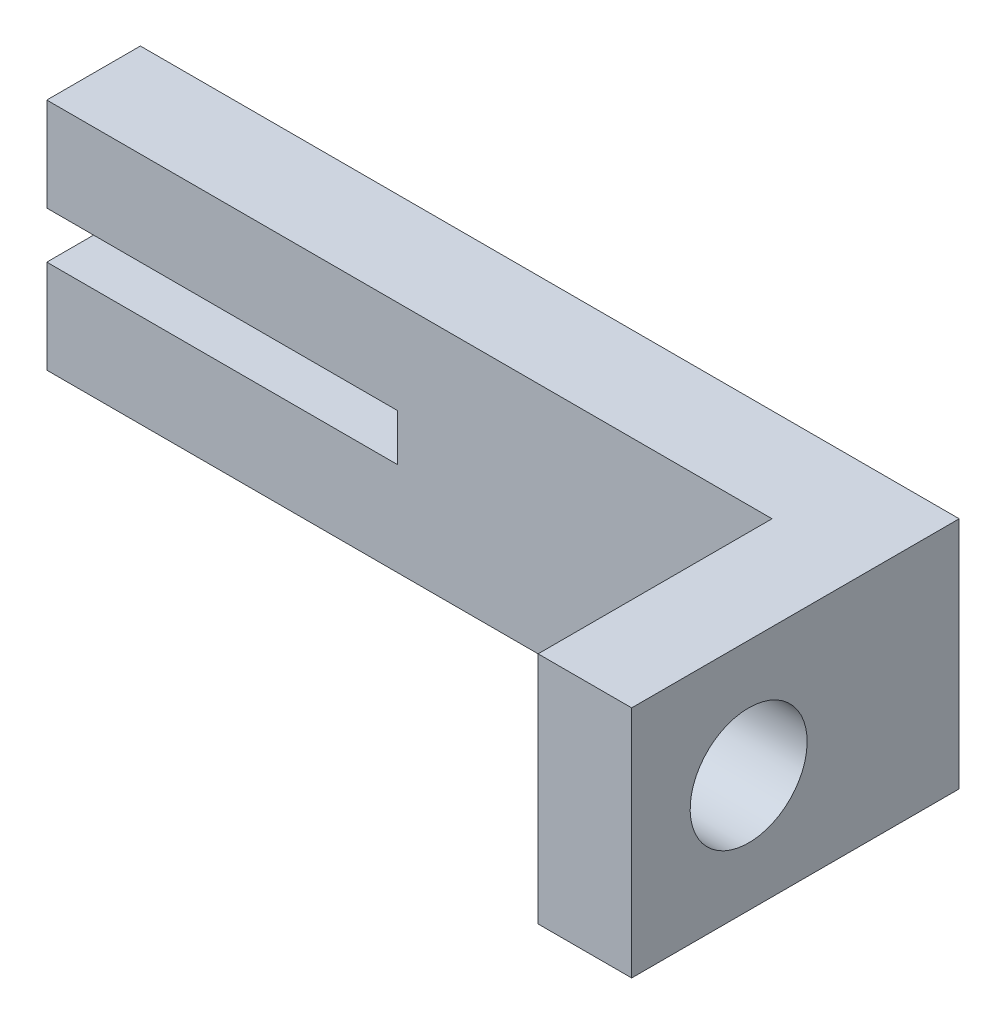
ISO-10303-21;
HEADER;
FILE_DESCRIPTION(('STEP AP214'),'2;1');
FILE_NAME('part.step','',(''),(''),'','','');
FILE_SCHEMA(('AUTOMOTIVE_DESIGN { 1 0 10303 214 1 1 1 1 }'));
ENDSEC;
DATA;
#1=APPLICATION_CONTEXT('core data for automotive mechanical design processes');
#2=APPLICATION_PROTOCOL_DEFINITION('international standard','automotive_design',2000,#1);
#3=PRODUCT_CONTEXT('',#1,'mechanical');
#4=PRODUCT('Part','Part','',(#3));
#5=PRODUCT_RELATED_PRODUCT_CATEGORY('part','',(#4));
#6=PRODUCT_DEFINITION_FORMATION('','',#4);
#7=PRODUCT_DEFINITION_CONTEXT('part definition',#1,'design');
#8=PRODUCT_DEFINITION('design','',#6,#7);
#9=PRODUCT_DEFINITION_SHAPE('','',#8);
#10=(LENGTH_UNIT() NAMED_UNIT(*) SI_UNIT(.MILLI.,.METRE.));
#11=(NAMED_UNIT(*) PLANE_ANGLE_UNIT() SI_UNIT($,.RADIAN.));
#12=(NAMED_UNIT(*) SI_UNIT($,.STERADIAN.) SOLID_ANGLE_UNIT());
#13=UNCERTAINTY_MEASURE_WITH_UNIT(LENGTH_MEASURE(1.E-05),#10,'distance_accuracy_value','');
#14=(GEOMETRIC_REPRESENTATION_CONTEXT(3) GLOBAL_UNCERTAINTY_ASSIGNED_CONTEXT((#13)) GLOBAL_UNIT_ASSIGNED_CONTEXT((#10,
#11,#12)) REPRESENTATION_CONTEXT('',''));
#15=CARTESIAN_POINT('',(0.,0.,0.));
#16=DIRECTION('',(0.,0.,1.));
#17=DIRECTION('',(1.,0.,0.));
#18=AXIS2_PLACEMENT_3D('',#15,#16,#17);
#19=CARTESIAN_POINT('',(0.,0.,4.));
#20=DIRECTION('',(-1.,0.,0.));
#21=DIRECTION('',(0.,0.,1.));
#22=AXIS2_PLACEMENT_3D('',#19,#20,#21);
#23=PLANE('',#22);
#24=DIRECTION('',(0.,1.,0.));
#25=VECTOR('',#24,1.);
#26=CARTESIAN_POINT('',(0.,0.,0.));
#27=LINE('',#26,#25);
#28=CARTESIAN_POINT('',(0.,6.,0.));
#29=VERTEX_POINT('',#28);
#30=CARTESIAN_POINT('',(0.,10.,0.));
#31=VERTEX_POINT('',#30);
#32=EDGE_CURVE('E147',#29,#31,#27,.T.);
#33=ORIENTED_EDGE('',*,*,#32,.F.);
#34=DIRECTION('',(0.,0.,-1.));
#35=VECTOR('',#34,1.);
#36=CARTESIAN_POINT('',(0.,6.,4.));
#37=LINE('',#36,#35);
#38=CARTESIAN_POINT('',(0.,6.,4.));
#39=VERTEX_POINT('',#38);
#40=EDGE_CURVE('E11',#39,#29,#37,.T.);
#41=ORIENTED_EDGE('',*,*,#40,.F.);
#42=DIRECTION('',(0.,1.,0.));
#43=VECTOR('',#42,1.);
#44=CARTESIAN_POINT('',(0.,0.,4.));
#45=LINE('',#44,#43);
#46=CARTESIAN_POINT('',(0.,10.,4.));
#47=VERTEX_POINT('',#46);
#48=EDGE_CURVE('E174',#39,#47,#45,.T.);
#49=ORIENTED_EDGE('',*,*,#48,.T.);
#50=DIRECTION('',(0.,0.,-1.));
#51=VECTOR('',#50,1.);
#52=CARTESIAN_POINT('',(0.,10.,4.));
#53=LINE('',#52,#51);
#54=EDGE_CURVE('E65',#47,#31,#53,.T.);
#55=ORIENTED_EDGE('',*,*,#54,.T.);
#56=EDGE_LOOP('',(#33,#41,#49,#55));
#57=FACE_BOUND('',#56,.T.);
#58=ADVANCED_FACE('F41',(#57),#23,.T.);
#59=CARTESIAN_POINT('',(0.,6.,4.));
#60=DIRECTION('',(0.,1.,0.));
#61=DIRECTION('',(0.,0.,1.));
#62=AXIS2_PLACEMENT_3D('',#59,#60,#61);
#63=PLANE('',#62);
#64=DIRECTION('',(1.,0.,0.));
#65=VECTOR('',#64,1.);
#66=CARTESIAN_POINT('',(0.,6.,0.));
#67=LINE('',#66,#65);
#68=CARTESIAN_POINT('',(15.,6.,0.));
#69=VERTEX_POINT('',#68);
#70=EDGE_CURVE('E150',#29,#69,#67,.T.);
#71=ORIENTED_EDGE('',*,*,#70,.T.);
#72=DIRECTION('',(0.,0.,-1.));
#73=VECTOR('',#72,1.);
#74=CARTESIAN_POINT('',(15.,6.,4.));
#75=LINE('',#74,#73);
#76=CARTESIAN_POINT('',(15.,6.,4.));
#77=VERTEX_POINT('',#76);
#78=EDGE_CURVE('E50',#77,#69,#75,.T.);
#79=ORIENTED_EDGE('',*,*,#78,.F.);
#80=DIRECTION('',(1.,0.,0.));
#81=VECTOR('',#80,1.);
#82=CARTESIAN_POINT('',(0.,6.,4.));
#83=LINE('',#82,#81);
#84=EDGE_CURVE('E235',#39,#77,#83,.T.);
#85=ORIENTED_EDGE('',*,*,#84,.F.);
#86=ORIENTED_EDGE('',*,*,#40,.T.);
#87=EDGE_LOOP('',(#71,#79,#85,#86));
#88=FACE_BOUND('',#87,.T.);
#89=ADVANCED_FACE('F239',(#88),#63,.F.);
#90=CARTESIAN_POINT('',(15.,0.,4.));
#91=DIRECTION('',(1.,0.,0.));
#92=DIRECTION('',(0.,1.,0.));
#93=AXIS2_PLACEMENT_3D('',#90,#91,#92);
#94=PLANE('',#93);
#95=DIRECTION('',(0.,-1.,0.));
#96=VECTOR('',#95,1.);
#97=CARTESIAN_POINT('',(15.,0.,0.));
#98=LINE('',#97,#96);
#99=CARTESIAN_POINT('',(15.,4.,0.));
#100=VERTEX_POINT('',#99);
#101=EDGE_CURVE('E154',#69,#100,#98,.T.);
#102=ORIENTED_EDGE('',*,*,#101,.T.);
#103=DIRECTION('',(0.,0.,-1.));
#104=VECTOR('',#103,1.);
#105=CARTESIAN_POINT('',(15.,4.,4.));
#106=LINE('',#105,#104);
#107=CARTESIAN_POINT('',(15.,4.,4.));
#108=VERTEX_POINT('',#107);
#109=EDGE_CURVE('E124',#108,#100,#106,.T.);
#110=ORIENTED_EDGE('',*,*,#109,.F.);
#111=DIRECTION('',(0.,-1.,0.));
#112=VECTOR('',#111,1.);
#113=CARTESIAN_POINT('',(15.,0.,4.));
#114=LINE('',#113,#112);
#115=EDGE_CURVE('E131',#77,#108,#114,.T.);
#116=ORIENTED_EDGE('',*,*,#115,.F.);
#117=ORIENTED_EDGE('',*,*,#78,.T.);
#118=EDGE_LOOP('',(#102,#110,#116,#117));
#119=FACE_BOUND('',#118,.T.);
#120=ADVANCED_FACE('F193',(#119),#94,.F.);
#121=CARTESIAN_POINT('',(0.,4.,4.));
#122=DIRECTION('',(0.,1.,0.));
#123=DIRECTION('',(0.,0.,1.));
#124=AXIS2_PLACEMENT_3D('',#121,#122,#123);
#125=PLANE('',#124);
#126=DIRECTION('',(1.,0.,0.));
#127=VECTOR('',#126,1.);
#128=CARTESIAN_POINT('',(0.,4.,0.));
#129=LINE('',#128,#127);
#130=CARTESIAN_POINT('',(0.,4.,0.));
#131=VERTEX_POINT('',#130);
#132=EDGE_CURVE('E118',#131,#100,#129,.T.);
#133=ORIENTED_EDGE('',*,*,#132,.F.);
#134=DIRECTION('',(0.,0.,-1.));
#135=VECTOR('',#134,1.);
#136=CARTESIAN_POINT('',(0.,4.,4.));
#137=LINE('',#136,#135);
#138=CARTESIAN_POINT('',(0.,4.,4.));
#139=VERTEX_POINT('',#138);
#140=EDGE_CURVE('E113',#139,#131,#137,.T.);
#141=ORIENTED_EDGE('',*,*,#140,.F.);
#142=DIRECTION('',(1.,0.,0.));
#143=VECTOR('',#142,1.);
#144=CARTESIAN_POINT('',(0.,4.,4.));
#145=LINE('',#144,#143);
#146=EDGE_CURVE('E116',#139,#108,#145,.T.);
#147=ORIENTED_EDGE('',*,*,#146,.T.);
#148=ORIENTED_EDGE('',*,*,#109,.T.);
#149=EDGE_LOOP('',(#133,#141,#147,#148));
#150=FACE_BOUND('',#149,.T.);
#151=ADVANCED_FACE('F115',(#150),#125,.T.);
#152=CARTESIAN_POINT('',(0.,0.,4.));
#153=DIRECTION('',(-1.,0.,0.));
#154=DIRECTION('',(0.,0.,1.));
#155=AXIS2_PLACEMENT_3D('',#152,#153,#154);
#156=PLANE('',#155);
#157=DIRECTION('',(0.,1.,0.));
#158=VECTOR('',#157,1.);
#159=CARTESIAN_POINT('',(0.,0.,0.));
#160=LINE('',#159,#158);
#161=CARTESIAN_POINT('',(0.,0.,0.));
#162=VERTEX_POINT('',#161);
#163=EDGE_CURVE('E160',#162,#131,#160,.T.);
#164=ORIENTED_EDGE('',*,*,#163,.F.);
#165=DIRECTION('',(0.,0.,-1.));
#166=VECTOR('',#165,1.);
#167=CARTESIAN_POINT('',(0.,0.,4.));
#168=LINE('',#167,#166);
#169=CARTESIAN_POINT('',(0.,0.,4.));
#170=VERTEX_POINT('',#169);
#171=EDGE_CURVE('E125',#170,#162,#168,.T.);
#172=ORIENTED_EDGE('',*,*,#171,.F.);
#173=DIRECTION('',(0.,1.,0.));
#174=VECTOR('',#173,1.);
#175=CARTESIAN_POINT('',(0.,0.,4.));
#176=LINE('',#175,#174);
#177=EDGE_CURVE('E129',#170,#139,#176,.T.);
#178=ORIENTED_EDGE('',*,*,#177,.T.);
#179=ORIENTED_EDGE('',*,*,#140,.T.);
#180=EDGE_LOOP('',(#164,#172,#178,#179));
#181=FACE_BOUND('',#180,.T.);
#182=ADVANCED_FACE('F135',(#181),#156,.T.);
#183=CARTESIAN_POINT('',(0.,0.,4.));
#184=DIRECTION('',(0.,1.,0.));
#185=DIRECTION('',(0.,0.,1.));
#186=AXIS2_PLACEMENT_3D('',#183,#184,#185);
#187=PLANE('',#186);
#188=DIRECTION('',(1.,0.,0.));
#189=VECTOR('',#188,1.);
#190=CARTESIAN_POINT('',(0.,0.,0.));
#191=LINE('',#190,#189);
#192=CARTESIAN_POINT('',(35.,0.,0.));
#193=VERTEX_POINT('',#192);
#194=EDGE_CURVE('E163',#162,#193,#191,.T.);
#195=ORIENTED_EDGE('',*,*,#194,.T.);
#196=DIRECTION('',(0.,0.,-1.));
#197=VECTOR('',#196,1.);
#198=CARTESIAN_POINT('',(35.,0.,4.));
#199=LINE('',#198,#197);
#200=CARTESIAN_POINT('',(35.,0.,14.));
#201=VERTEX_POINT('',#200);
#202=EDGE_CURVE('E180',#201,#193,#199,.T.);
#203=ORIENTED_EDGE('',*,*,#202,.F.);
#204=DIRECTION('',(-1.,0.,0.));
#205=VECTOR('',#204,1.);
#206=CARTESIAN_POINT('',(35.,0.,14.));
#207=LINE('',#206,#205);
#208=CARTESIAN_POINT('',(31.,0.,14.));
#209=VERTEX_POINT('',#208);
#210=EDGE_CURVE('E229',#201,#209,#207,.T.);
#211=ORIENTED_EDGE('',*,*,#210,.T.);
#212=DIRECTION('',(0.,0.,-1.));
#213=VECTOR('',#212,1.);
#214=CARTESIAN_POINT('',(31.,0.,14.));
#215=LINE('',#214,#213);
#216=CARTESIAN_POINT('',(31.,0.,4.));
#217=VERTEX_POINT('',#216);
#218=EDGE_CURVE('E216',#209,#217,#215,.T.);
#219=ORIENTED_EDGE('',*,*,#218,.T.);
#220=DIRECTION('',(1.,0.,0.));
#221=VECTOR('',#220,1.);
#222=CARTESIAN_POINT('',(0.,0.,4.));
#223=LINE('',#222,#221);
#224=EDGE_CURVE('E138',#170,#217,#223,.T.);
#225=ORIENTED_EDGE('',*,*,#224,.F.);
#226=ORIENTED_EDGE('',*,*,#171,.T.);
#227=EDGE_LOOP('',(#195,#203,#211,#219,#225,#226));
#228=FACE_BOUND('',#227,.T.);
#229=ADVANCED_FACE('F202',(#228),#187,.F.);
#230=CARTESIAN_POINT('',(35.,0.,4.));
#231=DIRECTION('',(-1.,0.,0.));
#232=DIRECTION('',(0.,-1.,0.));
#233=AXIS2_PLACEMENT_3D('',#230,#231,#232);
#234=PLANE('',#233);
#235=CARTESIAN_POINT('',(35.,5.,9.));
#236=DIRECTION('',(1.,0.,0.));
#237=DIRECTION('',(0.,1.,0.));
#238=AXIS2_PLACEMENT_3D('',#235,#236,#237);
#239=CIRCLE('',#238,2.5);
#240=CARTESIAN_POINT('',(35.,7.5,9.));
#241=VERTEX_POINT('',#240);
#242=EDGE_CURVE('E278',#241,#241,#239,.T.);
#243=ORIENTED_EDGE('',*,*,#242,.F.);
#244=EDGE_LOOP('',(#243));
#245=FACE_BOUND('',#244,.T.);
#246=DIRECTION('',(0.,1.,0.));
#247=VECTOR('',#246,1.);
#248=CARTESIAN_POINT('',(35.,0.,0.));
#249=LINE('',#248,#247);
#250=CARTESIAN_POINT('',(35.,10.,0.));
#251=VERTEX_POINT('',#250);
#252=EDGE_CURVE('E166',#193,#251,#249,.T.);
#253=ORIENTED_EDGE('',*,*,#252,.T.);
#254=DIRECTION('',(0.,0.,-1.));
#255=VECTOR('',#254,1.);
#256=CARTESIAN_POINT('',(35.,10.,4.));
#257=LINE('',#256,#255);
#258=CARTESIAN_POINT('',(35.,10.,14.));
#259=VERTEX_POINT('',#258);
#260=EDGE_CURVE('E177',#259,#251,#257,.T.);
#261=ORIENTED_EDGE('',*,*,#260,.F.);
#262=DIRECTION('',(0.,-1.,0.));
#263=VECTOR('',#262,1.);
#264=CARTESIAN_POINT('',(35.,10.,14.));
#265=LINE('',#264,#263);
#266=EDGE_CURVE('E210',#259,#201,#265,.T.);
#267=ORIENTED_EDGE('',*,*,#266,.T.);
#268=ORIENTED_EDGE('',*,*,#202,.T.);
#269=EDGE_LOOP('',(#253,#261,#267,#268));
#270=FACE_BOUND('',#269,.T.);
#271=ADVANCED_FACE('F207',(#245,#270),#234,.F.);
#272=CARTESIAN_POINT('',(0.,10.,4.));
#273=DIRECTION('',(0.,1.,0.));
#274=DIRECTION('',(0.,0.,1.));
#275=AXIS2_PLACEMENT_3D('',#272,#273,#274);
#276=PLANE('',#275);
#277=DIRECTION('',(1.,0.,0.));
#278=VECTOR('',#277,1.);
#279=CARTESIAN_POINT('',(0.,10.,0.));
#280=LINE('',#279,#278);
#281=EDGE_CURVE('E170',#31,#251,#280,.T.);
#282=ORIENTED_EDGE('',*,*,#281,.F.);
#283=ORIENTED_EDGE('',*,*,#54,.F.);
#284=DIRECTION('',(1.,0.,0.));
#285=VECTOR('',#284,1.);
#286=CARTESIAN_POINT('',(0.,10.,4.));
#287=LINE('',#286,#285);
#288=CARTESIAN_POINT('',(31.,10.,4.));
#289=VERTEX_POINT('',#288);
#290=EDGE_CURVE('E141',#47,#289,#287,.T.);
#291=ORIENTED_EDGE('',*,*,#290,.T.);
#292=DIRECTION('',(0.,0.,-1.));
#293=VECTOR('',#292,1.);
#294=CARTESIAN_POINT('',(31.,10.,14.));
#295=LINE('',#294,#293);
#296=CARTESIAN_POINT('',(31.,10.,14.));
#297=VERTEX_POINT('',#296);
#298=EDGE_CURVE('E151',#297,#289,#295,.T.);
#299=ORIENTED_EDGE('',*,*,#298,.F.);
#300=DIRECTION('',(-1.,0.,0.));
#301=VECTOR('',#300,1.);
#302=CARTESIAN_POINT('',(35.,10.,14.));
#303=LINE('',#302,#301);
#304=EDGE_CURVE('E217',#259,#297,#303,.T.);
#305=ORIENTED_EDGE('',*,*,#304,.F.);
#306=ORIENTED_EDGE('',*,*,#260,.T.);
#307=EDGE_LOOP('',(#282,#283,#291,#299,#305,#306));
#308=FACE_BOUND('',#307,.T.);
#309=ADVANCED_FACE('F255',(#308),#276,.T.);
#310=CARTESIAN_POINT('',(0.,0.,4.));
#311=DIRECTION('',(0.,0.,1.));
#312=DIRECTION('',(1.,0.,0.));
#313=AXIS2_PLACEMENT_3D('',#310,#311,#312);
#314=PLANE('',#313);
#315=DIRECTION('',(0.,-1.,0.));
#316=VECTOR('',#315,1.);
#317=CARTESIAN_POINT('',(31.,10.,4.));
#318=LINE('',#317,#316);
#319=EDGE_CURVE('E57',#289,#217,#318,.T.);
#320=ORIENTED_EDGE('',*,*,#319,.F.);
#321=ORIENTED_EDGE('',*,*,#290,.F.);
#322=ORIENTED_EDGE('',*,*,#48,.F.);
#323=ORIENTED_EDGE('',*,*,#84,.T.);
#324=ORIENTED_EDGE('',*,*,#115,.T.);
#325=ORIENTED_EDGE('',*,*,#146,.F.);
#326=ORIENTED_EDGE('',*,*,#177,.F.);
#327=ORIENTED_EDGE('',*,*,#224,.T.);
#328=EDGE_LOOP('',(#320,#321,#322,#323,#324,#325,#326,#327));
#329=FACE_BOUND('',#328,.T.);
#330=ADVANCED_FACE('F128',(#329),#314,.T.);
#331=CARTESIAN_POINT('',(0.,0.,0.));
#332=DIRECTION('',(0.,0.,1.));
#333=DIRECTION('',(1.,0.,0.));
#334=AXIS2_PLACEMENT_3D('',#331,#332,#333);
#335=PLANE('',#334);
#336=ORIENTED_EDGE('',*,*,#32,.T.);
#337=ORIENTED_EDGE('',*,*,#281,.T.);
#338=ORIENTED_EDGE('',*,*,#252,.F.);
#339=ORIENTED_EDGE('',*,*,#194,.F.);
#340=ORIENTED_EDGE('',*,*,#163,.T.);
#341=ORIENTED_EDGE('',*,*,#132,.T.);
#342=ORIENTED_EDGE('',*,*,#101,.F.);
#343=ORIENTED_EDGE('',*,*,#70,.F.);
#344=EDGE_LOOP('',(#336,#337,#338,#339,#340,#341,#342,#343));
#345=FACE_BOUND('',#344,.T.);
#346=ADVANCED_FACE('F197',(#345),#335,.F.);
#347=CARTESIAN_POINT('',(31.,10.,14.));
#348=DIRECTION('',(1.,0.,0.));
#349=DIRECTION('',(0.,0.,-1.));
#350=AXIS2_PLACEMENT_3D('',#347,#348,#349);
#351=PLANE('',#350);
#352=CARTESIAN_POINT('',(31.,5.,9.));
#353=DIRECTION('',(1.,0.,0.));
#354=DIRECTION('',(0.,0.,-1.));
#355=AXIS2_PLACEMENT_3D('',#352,#353,#354);
#356=CIRCLE('',#355,2.5);
#357=CARTESIAN_POINT('',(31.,5.,6.5));
#358=VERTEX_POINT('',#357);
#359=EDGE_CURVE('E44',#358,#358,#356,.T.);
#360=ORIENTED_EDGE('',*,*,#359,.T.);
#361=EDGE_LOOP('',(#360));
#362=FACE_BOUND('',#361,.T.);
#363=ORIENTED_EDGE('',*,*,#319,.T.);
#364=ORIENTED_EDGE('',*,*,#218,.F.);
#365=DIRECTION('',(0.,-1.,0.));
#366=VECTOR('',#365,1.);
#367=CARTESIAN_POINT('',(31.,10.,14.));
#368=LINE('',#367,#366);
#369=EDGE_CURVE('E223',#297,#209,#368,.T.);
#370=ORIENTED_EDGE('',*,*,#369,.F.);
#371=ORIENTED_EDGE('',*,*,#298,.T.);
#372=EDGE_LOOP('',(#363,#364,#370,#371));
#373=FACE_BOUND('',#372,.T.);
#374=ADVANCED_FACE('F261',(#362,#373),#351,.F.);
#375=CARTESIAN_POINT('',(0.,0.,14.));
#376=DIRECTION('',(0.,0.,1.));
#377=DIRECTION('',(1.,0.,0.));
#378=AXIS2_PLACEMENT_3D('',#375,#376,#377);
#379=PLANE('',#378);
#380=ORIENTED_EDGE('',*,*,#210,.F.);
#381=ORIENTED_EDGE('',*,*,#266,.F.);
#382=ORIENTED_EDGE('',*,*,#304,.T.);
#383=ORIENTED_EDGE('',*,*,#369,.T.);
#384=EDGE_LOOP('',(#380,#381,#382,#383));
#385=FACE_BOUND('',#384,.T.);
#386=ADVANCED_FACE('F266',(#385),#379,.T.);
#387=CARTESIAN_POINT('',(25.,4.99999999999999,9.));
#388=DIRECTION('',(1.,0.,0.));
#389=DIRECTION('',(0.,1.,0.));
#390=AXIS2_PLACEMENT_3D('',#387,#388,#389);
#391=CYLINDRICAL_SURFACE('',#390,2.5);
#392=ORIENTED_EDGE('',*,*,#242,.T.);
#393=EDGE_LOOP('',(#392));
#394=FACE_BOUND('',#393,.T.);
#395=ORIENTED_EDGE('',*,*,#359,.F.);
#396=EDGE_LOOP('',(#395));
#397=FACE_BOUND('',#396,.T.);
#398=ADVANCED_FACE('F270',(#394,#397),#391,.F.);
#399=CLOSED_SHELL('',(#58,#89,#120,#151,#182,#229,#271,#309,#330,#346,#374,#386,#398));
#400=MANIFOLD_SOLID_BREP('B2',#399);
#401=ADVANCED_BREP_SHAPE_REPRESENTATION('',(#18,#400),#14);
#402=SHAPE_DEFINITION_REPRESENTATION(#9,#401);
ENDSEC;
END-ISO-10303-21;
